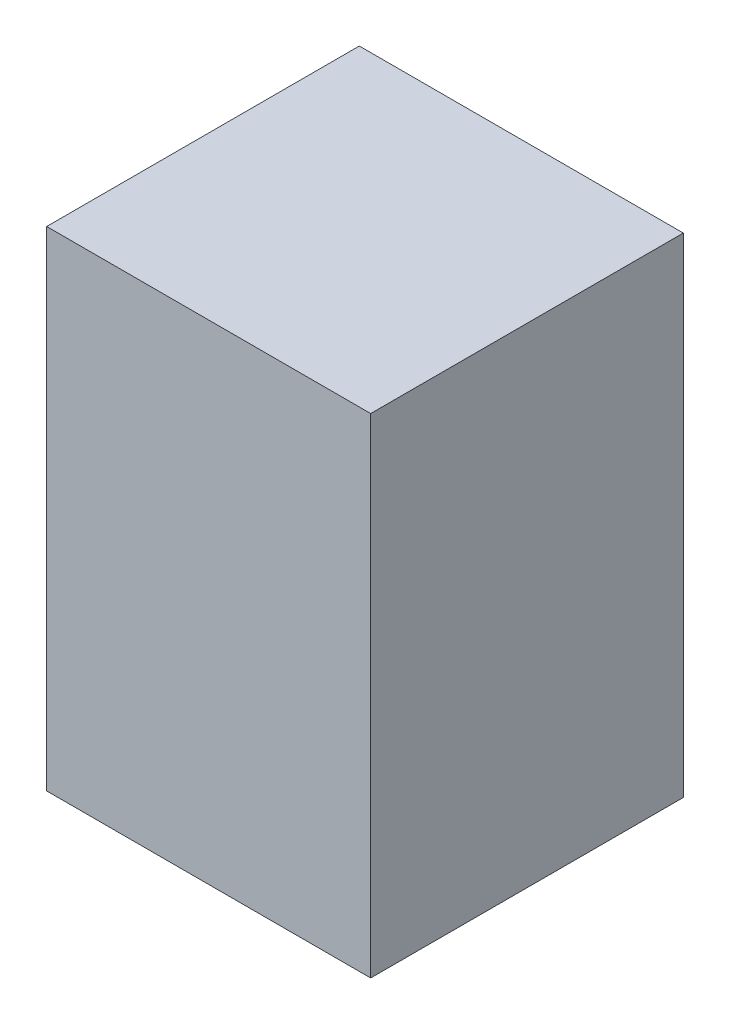
ISO-10303-21;
HEADER;
FILE_DESCRIPTION(('STEP AP214'),'2;1');
FILE_NAME('part.step','',(''),(''),'','','');
FILE_SCHEMA(('AUTOMOTIVE_DESIGN { 1 0 10303 214 1 1 1 1 }'));
ENDSEC;
DATA;
#1=APPLICATION_CONTEXT('core data for automotive mechanical design processes');
#2=APPLICATION_PROTOCOL_DEFINITION('international standard','automotive_design',2000,#1);
#3=PRODUCT_CONTEXT('',#1,'mechanical');
#4=PRODUCT('Part','Part','',(#3));
#5=PRODUCT_RELATED_PRODUCT_CATEGORY('part','',(#4));
#6=PRODUCT_DEFINITION_FORMATION('','',#4);
#7=PRODUCT_DEFINITION_CONTEXT('part definition',#1,'design');
#8=PRODUCT_DEFINITION('design','',#6,#7);
#9=PRODUCT_DEFINITION_SHAPE('','',#8);
#10=(LENGTH_UNIT() NAMED_UNIT(*) SI_UNIT(.MILLI.,.METRE.));
#11=(NAMED_UNIT(*) PLANE_ANGLE_UNIT() SI_UNIT($,.RADIAN.));
#12=(NAMED_UNIT(*) SI_UNIT($,.STERADIAN.) SOLID_ANGLE_UNIT());
#13=UNCERTAINTY_MEASURE_WITH_UNIT(LENGTH_MEASURE(1.E-05),#10,'distance_accuracy_value','');
#14=(GEOMETRIC_REPRESENTATION_CONTEXT(3) GLOBAL_UNCERTAINTY_ASSIGNED_CONTEXT((#13)) GLOBAL_UNIT_ASSIGNED_CONTEXT((#10,
#11,#12)) REPRESENTATION_CONTEXT('',''));
#15=CARTESIAN_POINT('',(0.,0.,0.));
#16=DIRECTION('',(0.,0.,1.));
#17=DIRECTION('',(1.,0.,0.));
#18=AXIS2_PLACEMENT_3D('',#15,#16,#17);
#19=CARTESIAN_POINT('',(57.,0.,55.));
#20=DIRECTION('',(0.,1.,0.));
#21=DIRECTION('',(0.,0.,1.));
#22=AXIS2_PLACEMENT_3D('',#19,#20,#21);
#23=PLANE('',#22);
#24=DIRECTION('',(1.,0.,0.));
#25=VECTOR('',#24,1.);
#26=CARTESIAN_POINT('',(57.,0.,0.));
#27=LINE('',#26,#25);
#28=CARTESIAN_POINT('',(0.,0.,0.));
#29=VERTEX_POINT('',#28);
#30=CARTESIAN_POINT('',(57.,0.,0.));
#31=VERTEX_POINT('',#30);
#32=EDGE_CURVE('E96',#29,#31,#27,.T.);
#33=ORIENTED_EDGE('',*,*,#32,.T.);
#34=DIRECTION('',(0.,0.,-1.));
#35=VECTOR('',#34,1.);
#36=CARTESIAN_POINT('',(57.,0.,55.));
#37=LINE('',#36,#35);
#38=CARTESIAN_POINT('',(57.,0.,55.));
#39=VERTEX_POINT('',#38);
#40=EDGE_CURVE('E11',#39,#31,#37,.T.);
#41=ORIENTED_EDGE('',*,*,#40,.F.);
#42=DIRECTION('',(1.,0.,0.));
#43=VECTOR('',#42,1.);
#44=CARTESIAN_POINT('',(57.,0.,55.));
#45=LINE('',#44,#43);
#46=CARTESIAN_POINT('',(0.,0.,55.));
#47=VERTEX_POINT('',#46);
#48=EDGE_CURVE('E84',#47,#39,#45,.T.);
#49=ORIENTED_EDGE('',*,*,#48,.F.);
#50=DIRECTION('',(0.,0.,-1.));
#51=VECTOR('',#50,1.);
#52=CARTESIAN_POINT('',(0.,0.,55.));
#53=LINE('',#52,#51);
#54=EDGE_CURVE('E92',#47,#29,#53,.T.);
#55=ORIENTED_EDGE('',*,*,#54,.T.);
#56=EDGE_LOOP('',(#33,#41,#49,#55));
#57=FACE_BOUND('',#56,.T.);
#58=ADVANCED_FACE('F33',(#57),#23,.F.);
#59=CARTESIAN_POINT('',(57.,86.,55.));
#60=DIRECTION('',(-1.,0.,0.));
#61=DIRECTION('',(0.,0.,1.));
#62=AXIS2_PLACEMENT_3D('',#59,#60,#61);
#63=PLANE('',#62);
#64=DIRECTION('',(0.,1.,0.));
#65=VECTOR('',#64,1.);
#66=CARTESIAN_POINT('',(57.,86.,0.));
#67=LINE('',#66,#65);
#68=CARTESIAN_POINT('',(57.,86.,0.));
#69=VERTEX_POINT('',#68);
#70=EDGE_CURVE('E88',#31,#69,#67,.T.);
#71=ORIENTED_EDGE('',*,*,#70,.T.);
#72=DIRECTION('',(0.,0.,-1.));
#73=VECTOR('',#72,1.);
#74=CARTESIAN_POINT('',(57.,86.,55.));
#75=LINE('',#74,#73);
#76=CARTESIAN_POINT('',(57.,86.,55.));
#77=VERTEX_POINT('',#76);
#78=EDGE_CURVE('E41',#77,#69,#75,.T.);
#79=ORIENTED_EDGE('',*,*,#78,.F.);
#80=DIRECTION('',(0.,1.,0.));
#81=VECTOR('',#80,1.);
#82=CARTESIAN_POINT('',(57.,86.,55.));
#83=LINE('',#82,#81);
#84=EDGE_CURVE('E79',#39,#77,#83,.T.);
#85=ORIENTED_EDGE('',*,*,#84,.F.);
#86=ORIENTED_EDGE('',*,*,#40,.T.);
#87=EDGE_LOOP('',(#71,#79,#85,#86));
#88=FACE_BOUND('',#87,.T.);
#89=ADVANCED_FACE('F87',(#88),#63,.F.);
#90=CARTESIAN_POINT('',(0.,86.,55.));
#91=DIRECTION('',(0.,-1.,0.));
#92=DIRECTION('',(0.,0.,-1.));
#93=AXIS2_PLACEMENT_3D('',#90,#91,#92);
#94=PLANE('',#93);
#95=DIRECTION('',(-1.,0.,0.));
#96=VECTOR('',#95,1.);
#97=CARTESIAN_POINT('',(0.,86.,0.));
#98=LINE('',#97,#96);
#99=CARTESIAN_POINT('',(0.,86.,0.));
#100=VERTEX_POINT('',#99);
#101=EDGE_CURVE('E66',#69,#100,#98,.T.);
#102=ORIENTED_EDGE('',*,*,#101,.T.);
#103=DIRECTION('',(0.,0.,-1.));
#104=VECTOR('',#103,1.);
#105=CARTESIAN_POINT('',(0.,86.,55.));
#106=LINE('',#105,#104);
#107=CARTESIAN_POINT('',(0.,86.,55.));
#108=VERTEX_POINT('',#107);
#109=EDGE_CURVE('E89',#108,#100,#106,.T.);
#110=ORIENTED_EDGE('',*,*,#109,.F.);
#111=DIRECTION('',(-1.,0.,0.));
#112=VECTOR('',#111,1.);
#113=CARTESIAN_POINT('',(0.,86.,55.));
#114=LINE('',#113,#112);
#115=EDGE_CURVE('E82',#77,#108,#114,.T.);
#116=ORIENTED_EDGE('',*,*,#115,.F.);
#117=ORIENTED_EDGE('',*,*,#78,.T.);
#118=EDGE_LOOP('',(#102,#110,#116,#117));
#119=FACE_BOUND('',#118,.T.);
#120=ADVANCED_FACE('F90',(#119),#94,.F.);
#121=CARTESIAN_POINT('',(0.,0.,55.));
#122=DIRECTION('',(1.,0.,0.));
#123=DIRECTION('',(0.,0.,-1.));
#124=AXIS2_PLACEMENT_3D('',#121,#122,#123);
#125=PLANE('',#124);
#126=DIRECTION('',(0.,-1.,0.));
#127=VECTOR('',#126,1.);
#128=CARTESIAN_POINT('',(0.,0.,0.));
#129=LINE('',#128,#127);
#130=EDGE_CURVE('E72',#100,#29,#129,.T.);
#131=ORIENTED_EDGE('',*,*,#130,.T.);
#132=ORIENTED_EDGE('',*,*,#54,.F.);
#133=DIRECTION('',(0.,-1.,0.));
#134=VECTOR('',#133,1.);
#135=CARTESIAN_POINT('',(0.,0.,55.));
#136=LINE('',#135,#134);
#137=EDGE_CURVE('E49',#108,#47,#136,.T.);
#138=ORIENTED_EDGE('',*,*,#137,.F.);
#139=ORIENTED_EDGE('',*,*,#109,.T.);
#140=EDGE_LOOP('',(#131,#132,#138,#139));
#141=FACE_BOUND('',#140,.T.);
#142=ADVANCED_FACE('F104',(#141),#125,.F.);
#143=CARTESIAN_POINT('',(0.,0.,55.));
#144=DIRECTION('',(0.,0.,-1.));
#145=DIRECTION('',(-1.,0.,0.));
#146=AXIS2_PLACEMENT_3D('',#143,#144,#145);
#147=PLANE('',#146);
#148=ORIENTED_EDGE('',*,*,#48,.T.);
#149=ORIENTED_EDGE('',*,*,#84,.T.);
#150=ORIENTED_EDGE('',*,*,#115,.T.);
#151=ORIENTED_EDGE('',*,*,#137,.T.);
#152=EDGE_LOOP('',(#148,#149,#150,#151));
#153=FACE_BOUND('',#152,.T.);
#154=ADVANCED_FACE('F80',(#153),#147,.F.);
#155=CARTESIAN_POINT('',(0.,0.,0.));
#156=DIRECTION('',(0.,0.,-1.));
#157=DIRECTION('',(-1.,0.,0.));
#158=AXIS2_PLACEMENT_3D('',#155,#156,#157);
#159=PLANE('',#158);
#160=CARTESIAN_POINT('',(53.,1.5,0.));
#161=DIRECTION('',(0.,0.,-1.));
#162=DIRECTION('',(-1.,0.,0.));
#163=AXIS2_PLACEMENT_3D('',#160,#161,#162);
#164=CIRCLE('',#163,0.499999999999999);
#165=CARTESIAN_POINT('',(52.5,1.5,0.));
#166=VERTEX_POINT('',#165);
#167=EDGE_CURVE('E123',#166,#166,#164,.T.);
#168=ORIENTED_EDGE('',*,*,#167,.F.);
#169=EDGE_LOOP('',(#168));
#170=FACE_BOUND('',#169,.T.);
#171=CARTESIAN_POINT('',(4.,84.5,0.));
#172=DIRECTION('',(0.,0.,-1.));
#173=DIRECTION('',(-1.,0.,0.));
#174=AXIS2_PLACEMENT_3D('',#171,#172,#173);
#175=CIRCLE('',#174,0.5);
#176=CARTESIAN_POINT('',(3.5,84.5,0.));
#177=VERTEX_POINT('',#176);
#178=EDGE_CURVE('E116',#177,#177,#175,.T.);
#179=ORIENTED_EDGE('',*,*,#178,.F.);
#180=EDGE_LOOP('',(#179));
#181=FACE_BOUND('',#180,.T.);
#182=CARTESIAN_POINT('',(53.,84.5,0.));
#183=DIRECTION('',(0.,0.,-1.));
#184=DIRECTION('',(-1.,0.,0.));
#185=AXIS2_PLACEMENT_3D('',#182,#183,#184);
#186=CIRCLE('',#185,0.499999999999999);
#187=CARTESIAN_POINT('',(52.5,84.5,0.));
#188=VERTEX_POINT('',#187);
#189=EDGE_CURVE('E128',#188,#188,#186,.T.);
#190=ORIENTED_EDGE('',*,*,#189,.F.);
#191=EDGE_LOOP('',(#190));
#192=FACE_BOUND('',#191,.T.);
#193=CARTESIAN_POINT('',(4.,1.5,0.));
#194=DIRECTION('',(0.,0.,-1.));
#195=DIRECTION('',(-1.,0.,0.));
#196=AXIS2_PLACEMENT_3D('',#193,#194,#195);
#197=CIRCLE('',#196,0.5);
#198=CARTESIAN_POINT('',(3.5,1.5,0.));
#199=VERTEX_POINT('',#198);
#200=EDGE_CURVE('E110',#199,#199,#197,.T.);
#201=ORIENTED_EDGE('',*,*,#200,.F.);
#202=EDGE_LOOP('',(#201));
#203=FACE_BOUND('',#202,.T.);
#204=ORIENTED_EDGE('',*,*,#32,.F.);
#205=ORIENTED_EDGE('',*,*,#130,.F.);
#206=ORIENTED_EDGE('',*,*,#101,.F.);
#207=ORIENTED_EDGE('',*,*,#70,.F.);
#208=EDGE_LOOP('',(#204,#205,#206,#207));
#209=FACE_BOUND('',#208,.T.);
#210=ADVANCED_FACE('F107',(#170,#181,#192,#203,#209),#159,.T.);
#211=CARTESIAN_POINT('',(4.,1.5,5.));
#212=DIRECTION('',(0.,0.,-1.));
#213=DIRECTION('',(-1.,0.,0.));
#214=AXIS2_PLACEMENT_3D('',#211,#212,#213);
#215=CYLINDRICAL_SURFACE('',#214,0.5);
#216=CARTESIAN_POINT('',(4.,1.5,5.));
#217=DIRECTION('',(0.,0.,-1.));
#218=DIRECTION('',(-1.,0.,0.));
#219=AXIS2_PLACEMENT_3D('',#216,#217,#218);
#220=CIRCLE('',#219,0.5);
#221=CARTESIAN_POINT('',(3.5,1.5,5.));
#222=VERTEX_POINT('',#221);
#223=EDGE_CURVE('E99',#222,#222,#220,.T.);
#224=ORIENTED_EDGE('',*,*,#223,.F.);
#225=EDGE_LOOP('',(#224));
#226=FACE_BOUND('',#225,.T.);
#227=ORIENTED_EDGE('',*,*,#200,.T.);
#228=EDGE_LOOP('',(#227));
#229=FACE_BOUND('',#228,.T.);
#230=ADVANCED_FACE('F145',(#226,#229),#215,.F.);
#231=CARTESIAN_POINT('',(4.,1.5,5.));
#232=DIRECTION('',(0.,0.,-1.));
#233=DIRECTION('',(-1.,0.,0.));
#234=AXIS2_PLACEMENT_3D('',#231,#232,#233);
#235=PLANE('',#234);
#236=ORIENTED_EDGE('',*,*,#223,.T.);
#237=EDGE_LOOP('',(#236));
#238=FACE_BOUND('',#237,.T.);
#239=ADVANCED_FACE('F139',(#238),#235,.T.);
#240=CARTESIAN_POINT('',(53.,84.5,5.));
#241=DIRECTION('',(0.,0.,-1.));
#242=DIRECTION('',(-1.,0.,0.));
#243=AXIS2_PLACEMENT_3D('',#240,#241,#242);
#244=CYLINDRICAL_SURFACE('',#243,0.499999999999999);
#245=CARTESIAN_POINT('',(53.,84.5,5.));
#246=DIRECTION('',(0.,0.,-1.));
#247=DIRECTION('',(-1.,0.,0.));
#248=AXIS2_PLACEMENT_3D('',#245,#246,#247);
#249=CIRCLE('',#248,0.499999999999999);
#250=CARTESIAN_POINT('',(52.5,84.5,5.));
#251=VERTEX_POINT('',#250);
#252=EDGE_CURVE('E120',#251,#251,#249,.T.);
#253=ORIENTED_EDGE('',*,*,#252,.F.);
#254=EDGE_LOOP('',(#253));
#255=FACE_BOUND('',#254,.T.);
#256=ORIENTED_EDGE('',*,*,#189,.T.);
#257=EDGE_LOOP('',(#256));
#258=FACE_BOUND('',#257,.T.);
#259=ADVANCED_FACE('F136',(#255,#258),#244,.F.);
#260=CARTESIAN_POINT('',(53.,84.5,5.));
#261=DIRECTION('',(0.,0.,-1.));
#262=DIRECTION('',(-1.,0.,0.));
#263=AXIS2_PLACEMENT_3D('',#260,#261,#262);
#264=PLANE('',#263);
#265=ORIENTED_EDGE('',*,*,#252,.T.);
#266=EDGE_LOOP('',(#265));
#267=FACE_BOUND('',#266,.T.);
#268=ADVANCED_FACE('F134',(#267),#264,.T.);
#269=CARTESIAN_POINT('',(4.,84.5,5.));
#270=DIRECTION('',(0.,0.,-1.));
#271=DIRECTION('',(-1.,0.,0.));
#272=AXIS2_PLACEMENT_3D('',#269,#270,#271);
#273=CYLINDRICAL_SURFACE('',#272,0.5);
#274=CARTESIAN_POINT('',(4.,84.5,5.));
#275=DIRECTION('',(0.,0.,-1.));
#276=DIRECTION('',(-1.,0.,0.));
#277=AXIS2_PLACEMENT_3D('',#274,#275,#276);
#278=CIRCLE('',#277,0.5);
#279=CARTESIAN_POINT('',(3.5,84.5,5.));
#280=VERTEX_POINT('',#279);
#281=EDGE_CURVE('E119',#280,#280,#278,.T.);
#282=ORIENTED_EDGE('',*,*,#281,.F.);
#283=EDGE_LOOP('',(#282));
#284=FACE_BOUND('',#283,.T.);
#285=ORIENTED_EDGE('',*,*,#178,.T.);
#286=EDGE_LOOP('',(#285));
#287=FACE_BOUND('',#286,.T.);
#288=ADVANCED_FACE('F204',(#284,#287),#273,.F.);
#289=CARTESIAN_POINT('',(4.,84.5,5.));
#290=DIRECTION('',(0.,0.,-1.));
#291=DIRECTION('',(-1.,0.,0.));
#292=AXIS2_PLACEMENT_3D('',#289,#290,#291);
#293=PLANE('',#292);
#294=ORIENTED_EDGE('',*,*,#281,.T.);
#295=EDGE_LOOP('',(#294));
#296=FACE_BOUND('',#295,.T.);
#297=ADVANCED_FACE('F213',(#296),#293,.T.);
#298=CARTESIAN_POINT('',(53.,1.5,5.));
#299=DIRECTION('',(0.,0.,-1.));
#300=DIRECTION('',(-1.,0.,0.));
#301=AXIS2_PLACEMENT_3D('',#298,#299,#300);
#302=CYLINDRICAL_SURFACE('',#301,0.499999999999999);
#303=CARTESIAN_POINT('',(53.,1.5,5.));
#304=DIRECTION('',(0.,0.,-1.));
#305=DIRECTION('',(-1.,0.,0.));
#306=AXIS2_PLACEMENT_3D('',#303,#304,#305);
#307=CIRCLE('',#306,0.499999999999999);
#308=CARTESIAN_POINT('',(52.5,1.5,5.));
#309=VERTEX_POINT('',#308);
#310=EDGE_CURVE('E113',#309,#309,#307,.T.);
#311=ORIENTED_EDGE('',*,*,#310,.F.);
#312=EDGE_LOOP('',(#311));
#313=FACE_BOUND('',#312,.T.);
#314=ORIENTED_EDGE('',*,*,#167,.T.);
#315=EDGE_LOOP('',(#314));
#316=FACE_BOUND('',#315,.T.);
#317=ADVANCED_FACE('F223',(#313,#316),#302,.F.);
#318=CARTESIAN_POINT('',(53.,1.5,5.));
#319=DIRECTION('',(0.,0.,-1.));
#320=DIRECTION('',(-1.,0.,0.));
#321=AXIS2_PLACEMENT_3D('',#318,#319,#320);
#322=PLANE('',#321);
#323=ORIENTED_EDGE('',*,*,#310,.T.);
#324=EDGE_LOOP('',(#323));
#325=FACE_BOUND('',#324,.T.);
#326=ADVANCED_FACE('F233',(#325),#322,.T.);
#327=CLOSED_SHELL('',(#58,#89,#120,#142,#154,#210,#230,#239,#259,#268,#288,#297,#317,#326));
#328=MANIFOLD_SOLID_BREP('B2',#327);
#329=ADVANCED_BREP_SHAPE_REPRESENTATION('',(#18,#328),#14);
#330=SHAPE_DEFINITION_REPRESENTATION(#9,#329);
ENDSEC;
END-ISO-10303-21;
